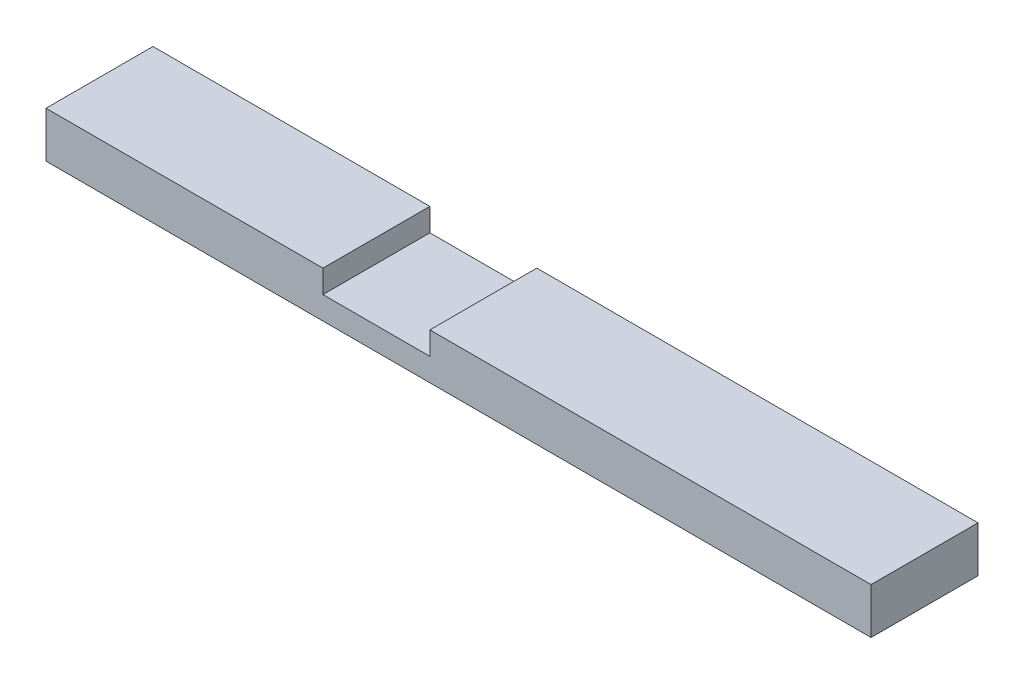
ISO-10303-21;
HEADER;
FILE_DESCRIPTION(('STEP AP214'),'2;1');
FILE_NAME('part.step','',(''),(''),'','','');
FILE_SCHEMA(('AUTOMOTIVE_DESIGN { 1 0 10303 214 1 1 1 1 }'));
ENDSEC;
DATA;
#1=APPLICATION_CONTEXT('core data for automotive mechanical design processes');
#2=APPLICATION_PROTOCOL_DEFINITION('international standard','automotive_design',2000,#1);
#3=PRODUCT_CONTEXT('',#1,'mechanical');
#4=PRODUCT('Part','Part','',(#3));
#5=PRODUCT_RELATED_PRODUCT_CATEGORY('part','',(#4));
#6=PRODUCT_DEFINITION_FORMATION('','',#4);
#7=PRODUCT_DEFINITION_CONTEXT('part definition',#1,'design');
#8=PRODUCT_DEFINITION('design','',#6,#7);
#9=PRODUCT_DEFINITION_SHAPE('','',#8);
#10=(LENGTH_UNIT() NAMED_UNIT(*) SI_UNIT(.MILLI.,.METRE.));
#11=(NAMED_UNIT(*) PLANE_ANGLE_UNIT() SI_UNIT($,.RADIAN.));
#12=(NAMED_UNIT(*) SI_UNIT($,.STERADIAN.) SOLID_ANGLE_UNIT());
#13=UNCERTAINTY_MEASURE_WITH_UNIT(LENGTH_MEASURE(1.E-05),#10,'distance_accuracy_value','');
#14=(GEOMETRIC_REPRESENTATION_CONTEXT(3) GLOBAL_UNCERTAINTY_ASSIGNED_CONTEXT((#13)) GLOBAL_UNIT_ASSIGNED_CONTEXT((#10,
#11,#12)) REPRESENTATION_CONTEXT('',''));
#15=CARTESIAN_POINT('',(0.,0.,0.));
#16=DIRECTION('',(0.,0.,1.));
#17=DIRECTION('',(1.,0.,0.));
#18=AXIS2_PLACEMENT_3D('',#15,#16,#17);
#19=CARTESIAN_POINT('',(0.,38.1,0.));
#20=DIRECTION('',(0.,-1.,0.));
#21=DIRECTION('',(0.,0.,-1.));
#22=AXIS2_PLACEMENT_3D('',#19,#20,#21);
#23=PLANE('',#22);
#24=DIRECTION('',(1.,0.,0.));
#25=VECTOR('',#24,1.);
#26=CARTESIAN_POINT('',(0.,38.1,0.));
#27=LINE('',#26,#25);
#28=CARTESIAN_POINT('',(0.,38.1,0.));
#29=VERTEX_POINT('',#28);
#30=CARTESIAN_POINT('',(230.1875,38.1,0.));
#31=VERTEX_POINT('',#30);
#32=EDGE_CURVE('E95',#29,#31,#27,.T.);
#33=ORIENTED_EDGE('',*,*,#32,.T.);
#34=DIRECTION('',(0.,0.,1.));
#35=VECTOR('',#34,1.);
#36=CARTESIAN_POINT('',(230.1875,38.1,-88.9));
#37=LINE('',#36,#35);
#38=CARTESIAN_POINT('',(230.1875,38.1,-88.9));
#39=VERTEX_POINT('',#38);
#40=EDGE_CURVE('E121',#39,#31,#37,.T.);
#41=ORIENTED_EDGE('',*,*,#40,.F.);
#42=DIRECTION('',(-1.,0.,0.));
#43=VECTOR('',#42,1.);
#44=CARTESIAN_POINT('',(0.,38.1,-88.9));
#45=LINE('',#44,#43);
#46=CARTESIAN_POINT('',(0.,38.1,-88.9));
#47=VERTEX_POINT('',#46);
#48=EDGE_CURVE('E66',#39,#47,#45,.T.);
#49=ORIENTED_EDGE('',*,*,#48,.T.);
#50=DIRECTION('',(0.,0.,1.));
#51=VECTOR('',#50,1.);
#52=CARTESIAN_POINT('',(0.,38.1,0.));
#53=LINE('',#52,#51);
#54=EDGE_CURVE('E161',#47,#29,#53,.T.);
#55=ORIENTED_EDGE('',*,*,#54,.T.);
#56=EDGE_LOOP('',(#33,#41,#49,#55));
#57=FACE_BOUND('',#56,.T.);
#58=ADVANCED_FACE('F41',(#57),#23,.F.);
#59=CARTESIAN_POINT('',(0.,38.1,0.));
#60=DIRECTION('',(1.,0.,0.));
#61=DIRECTION('',(0.,0.,-1.));
#62=AXIS2_PLACEMENT_3D('',#59,#60,#61);
#63=PLANE('',#62);
#64=DIRECTION('',(0.,0.,1.));
#65=VECTOR('',#64,1.);
#66=CARTESIAN_POINT('',(0.,0.,0.));
#67=LINE('',#66,#65);
#68=CARTESIAN_POINT('',(0.,0.,-88.9));
#69=VERTEX_POINT('',#68);
#70=CARTESIAN_POINT('',(0.,0.,0.));
#71=VERTEX_POINT('',#70);
#72=EDGE_CURVE('E154',#69,#71,#67,.T.);
#73=ORIENTED_EDGE('',*,*,#72,.T.);
#74=DIRECTION('',(0.,-1.,0.));
#75=VECTOR('',#74,1.);
#76=CARTESIAN_POINT('',(0.,38.1,0.));
#77=LINE('',#76,#75);
#78=EDGE_CURVE('E11',#29,#71,#77,.T.);
#79=ORIENTED_EDGE('',*,*,#78,.F.);
#80=ORIENTED_EDGE('',*,*,#54,.F.);
#81=DIRECTION('',(0.,-1.,0.));
#82=VECTOR('',#81,1.);
#83=CARTESIAN_POINT('',(0.,38.1,-88.9));
#84=LINE('',#83,#82);
#85=EDGE_CURVE('E174',#47,#69,#84,.T.);
#86=ORIENTED_EDGE('',*,*,#85,.T.);
#87=EDGE_LOOP('',(#73,#79,#80,#86));
#88=FACE_BOUND('',#87,.T.);
#89=ADVANCED_FACE('F43',(#88),#63,.F.);
#90=CARTESIAN_POINT('',(0.,38.1,0.));
#91=DIRECTION('',(0.,0.,-1.));
#92=DIRECTION('',(-1.,0.,0.));
#93=AXIS2_PLACEMENT_3D('',#90,#91,#92);
#94=PLANE('',#93);
#95=DIRECTION('',(1.,0.,0.));
#96=VECTOR('',#95,1.);
#97=CARTESIAN_POINT('',(230.1875,19.05,0.));
#98=LINE('',#97,#96);
#99=CARTESIAN_POINT('',(230.1875,19.05,0.));
#100=VERTEX_POINT('',#99);
#101=CARTESIAN_POINT('',(319.0875,19.05,0.));
#102=VERTEX_POINT('',#101);
#103=EDGE_CURVE('E130',#100,#102,#98,.T.);
#104=ORIENTED_EDGE('',*,*,#103,.F.);
#105=DIRECTION('',(0.,1.,0.));
#106=VECTOR('',#105,1.);
#107=CARTESIAN_POINT('',(230.1875,19.05,0.));
#108=LINE('',#107,#106);
#109=EDGE_CURVE('E116',#100,#31,#108,.T.);
#110=ORIENTED_EDGE('',*,*,#109,.T.);
#111=ORIENTED_EDGE('',*,*,#32,.F.);
#112=ORIENTED_EDGE('',*,*,#78,.T.);
#113=DIRECTION('',(1.,0.,0.));
#114=VECTOR('',#113,1.);
#115=CARTESIAN_POINT('',(0.,0.,0.));
#116=LINE('',#115,#114);
#117=CARTESIAN_POINT('',(685.8,0.,0.));
#118=VERTEX_POINT('',#117);
#119=EDGE_CURVE('E178',#71,#118,#116,.T.);
#120=ORIENTED_EDGE('',*,*,#119,.T.);
#121=DIRECTION('',(0.,-1.,0.));
#122=VECTOR('',#121,1.);
#123=CARTESIAN_POINT('',(685.8,38.1,0.));
#124=LINE('',#123,#122);
#125=CARTESIAN_POINT('',(685.8,38.1,0.));
#126=VERTEX_POINT('',#125);
#127=EDGE_CURVE('E50',#126,#118,#124,.T.);
#128=ORIENTED_EDGE('',*,*,#127,.F.);
#129=CARTESIAN_POINT('',(319.0875,38.1,0.));
#130=VERTEX_POINT('',#129);
#131=EDGE_CURVE('E164',#130,#126,#27,.T.);
#132=ORIENTED_EDGE('',*,*,#131,.F.);
#133=DIRECTION('',(0.,1.,0.));
#134=VECTOR('',#133,1.);
#135=CARTESIAN_POINT('',(319.0875,19.05,0.));
#136=LINE('',#135,#134);
#137=EDGE_CURVE('E57',#102,#130,#136,.T.);
#138=ORIENTED_EDGE('',*,*,#137,.F.);
#139=EDGE_LOOP('',(#104,#110,#111,#112,#120,#128,#132,#138));
#140=FACE_BOUND('',#139,.T.);
#141=ADVANCED_FACE('F136',(#140),#94,.F.);
#142=CARTESIAN_POINT('',(685.8,38.1,0.));
#143=DIRECTION('',(-1.,0.,0.));
#144=DIRECTION('',(0.,0.,1.));
#145=AXIS2_PLACEMENT_3D('',#142,#143,#144);
#146=PLANE('',#145);
#147=DIRECTION('',(0.,0.,-1.));
#148=VECTOR('',#147,1.);
#149=CARTESIAN_POINT('',(685.8,0.,0.));
#150=LINE('',#149,#148);
#151=CARTESIAN_POINT('',(685.8,0.,-88.9));
#152=VERTEX_POINT('',#151);
#153=EDGE_CURVE('E181',#118,#152,#150,.T.);
#154=ORIENTED_EDGE('',*,*,#153,.T.);
#155=DIRECTION('',(0.,-1.,0.));
#156=VECTOR('',#155,1.);
#157=CARTESIAN_POINT('',(685.8,38.1,-88.9));
#158=LINE('',#157,#156);
#159=CARTESIAN_POINT('',(685.8,38.1,-88.9));
#160=VERTEX_POINT('',#159);
#161=EDGE_CURVE('E188',#160,#152,#158,.T.);
#162=ORIENTED_EDGE('',*,*,#161,.F.);
#163=DIRECTION('',(0.,0.,-1.));
#164=VECTOR('',#163,1.);
#165=CARTESIAN_POINT('',(685.8,38.1,0.));
#166=LINE('',#165,#164);
#167=EDGE_CURVE('E167',#126,#160,#166,.T.);
#168=ORIENTED_EDGE('',*,*,#167,.F.);
#169=ORIENTED_EDGE('',*,*,#127,.T.);
#170=EDGE_LOOP('',(#154,#162,#168,#169));
#171=FACE_BOUND('',#170,.T.);
#172=ADVANCED_FACE('F197',(#171),#146,.F.);
#173=CARTESIAN_POINT('',(0.,38.1,-88.9));
#174=DIRECTION('',(0.,0.,1.));
#175=DIRECTION('',(1.,0.,0.));
#176=AXIS2_PLACEMENT_3D('',#173,#174,#175);
#177=PLANE('',#176);
#178=ORIENTED_EDGE('',*,*,#48,.F.);
#179=DIRECTION('',(0.,1.,0.));
#180=VECTOR('',#179,1.);
#181=CARTESIAN_POINT('',(230.1875,19.05,-88.9));
#182=LINE('',#181,#180);
#183=CARTESIAN_POINT('',(230.1875,19.05,-88.9));
#184=VERTEX_POINT('',#183);
#185=EDGE_CURVE('E151',#184,#39,#182,.T.);
#186=ORIENTED_EDGE('',*,*,#185,.F.);
#187=DIRECTION('',(-1.,0.,0.));
#188=VECTOR('',#187,1.);
#189=CARTESIAN_POINT('',(230.1875,19.05,-88.9));
#190=LINE('',#189,#188);
#191=CARTESIAN_POINT('',(319.0875,19.05,-88.9));
#192=VERTEX_POINT('',#191);
#193=EDGE_CURVE('E124',#192,#184,#190,.T.);
#194=ORIENTED_EDGE('',*,*,#193,.F.);
#195=DIRECTION('',(0.,1.,0.));
#196=VECTOR('',#195,1.);
#197=CARTESIAN_POINT('',(319.0875,19.05,-88.9));
#198=LINE('',#197,#196);
#199=CARTESIAN_POINT('',(319.0875,38.1,-88.9));
#200=VERTEX_POINT('',#199);
#201=EDGE_CURVE('E155',#192,#200,#198,.T.);
#202=ORIENTED_EDGE('',*,*,#201,.T.);
#203=EDGE_CURVE('E170',#160,#200,#45,.T.);
#204=ORIENTED_EDGE('',*,*,#203,.F.);
#205=ORIENTED_EDGE('',*,*,#161,.T.);
#206=DIRECTION('',(-1.,0.,0.));
#207=VECTOR('',#206,1.);
#208=CARTESIAN_POINT('',(0.,0.,-88.9));
#209=LINE('',#208,#207);
#210=EDGE_CURVE('E88',#152,#69,#209,.T.);
#211=ORIENTED_EDGE('',*,*,#210,.T.);
#212=ORIENTED_EDGE('',*,*,#85,.F.);
#213=EDGE_LOOP('',(#178,#186,#194,#202,#204,#205,#211,#212));
#214=FACE_BOUND('',#213,.T.);
#215=ADVANCED_FACE('F205',(#214),#177,.F.);
#216=ORIENTED_EDGE('',*,*,#203,.T.);
#217=DIRECTION('',(0.,0.,-1.));
#218=VECTOR('',#217,1.);
#219=CARTESIAN_POINT('',(319.0875,38.1,-88.9));
#220=LINE('',#219,#218);
#221=EDGE_CURVE('E134',#130,#200,#220,.T.);
#222=ORIENTED_EDGE('',*,*,#221,.F.);
#223=ORIENTED_EDGE('',*,*,#131,.T.);
#224=ORIENTED_EDGE('',*,*,#167,.T.);
#225=EDGE_LOOP('',(#216,#222,#223,#224));
#226=FACE_BOUND('',#225,.T.);
#227=ADVANCED_FACE('F225',(#226),#23,.F.);
#228=CARTESIAN_POINT('',(0.,0.,0.));
#229=DIRECTION('',(0.,-1.,0.));
#230=DIRECTION('',(0.,0.,-1.));
#231=AXIS2_PLACEMENT_3D('',#228,#229,#230);
#232=PLANE('',#231);
#233=ORIENTED_EDGE('',*,*,#72,.F.);
#234=ORIENTED_EDGE('',*,*,#210,.F.);
#235=ORIENTED_EDGE('',*,*,#153,.F.);
#236=ORIENTED_EDGE('',*,*,#119,.F.);
#237=EDGE_LOOP('',(#233,#234,#235,#236));
#238=FACE_BOUND('',#237,.T.);
#239=ADVANCED_FACE('F201',(#238),#232,.T.);
#240=CARTESIAN_POINT('',(230.1875,19.05,-88.9));
#241=DIRECTION('',(-1.,0.,0.));
#242=DIRECTION('',(0.,0.,1.));
#243=AXIS2_PLACEMENT_3D('',#240,#241,#242);
#244=PLANE('',#243);
#245=ORIENTED_EDGE('',*,*,#40,.T.);
#246=ORIENTED_EDGE('',*,*,#109,.F.);
#247=DIRECTION('',(0.,0.,1.));
#248=VECTOR('',#247,1.);
#249=CARTESIAN_POINT('',(230.1875,19.05,-88.9));
#250=LINE('',#249,#248);
#251=EDGE_CURVE('E119',#184,#100,#250,.T.);
#252=ORIENTED_EDGE('',*,*,#251,.F.);
#253=ORIENTED_EDGE('',*,*,#185,.T.);
#254=EDGE_LOOP('',(#245,#246,#252,#253));
#255=FACE_BOUND('',#254,.T.);
#256=ADVANCED_FACE('F118',(#255),#244,.F.);
#257=CARTESIAN_POINT('',(319.0875,19.05,-88.9));
#258=DIRECTION('',(1.,0.,0.));
#259=DIRECTION('',(0.,0.,-1.));
#260=AXIS2_PLACEMENT_3D('',#257,#258,#259);
#261=PLANE('',#260);
#262=ORIENTED_EDGE('',*,*,#221,.T.);
#263=ORIENTED_EDGE('',*,*,#201,.F.);
#264=DIRECTION('',(0.,0.,-1.));
#265=VECTOR('',#264,1.);
#266=CARTESIAN_POINT('',(319.0875,19.05,-88.9));
#267=LINE('',#266,#265);
#268=EDGE_CURVE('E139',#102,#192,#267,.T.);
#269=ORIENTED_EDGE('',*,*,#268,.F.);
#270=ORIENTED_EDGE('',*,*,#137,.T.);
#271=EDGE_LOOP('',(#262,#263,#269,#270));
#272=FACE_BOUND('',#271,.T.);
#273=ADVANCED_FACE('F227',(#272),#261,.F.);
#274=CARTESIAN_POINT('',(0.,19.05,0.));
#275=DIRECTION('',(0.,1.,0.));
#276=DIRECTION('',(0.,0.,1.));
#277=AXIS2_PLACEMENT_3D('',#274,#275,#276);
#278=PLANE('',#277);
#279=ORIENTED_EDGE('',*,*,#251,.T.);
#280=ORIENTED_EDGE('',*,*,#103,.T.);
#281=ORIENTED_EDGE('',*,*,#268,.T.);
#282=ORIENTED_EDGE('',*,*,#193,.T.);
#283=EDGE_LOOP('',(#279,#280,#281,#282));
#284=FACE_BOUND('',#283,.T.);
#285=ADVANCED_FACE('F128',(#284),#278,.T.);
#286=CLOSED_SHELL('',(#58,#89,#141,#172,#215,#227,#239,#256,#273,#285));
#287=MANIFOLD_SOLID_BREP('B2',#286);
#288=ADVANCED_BREP_SHAPE_REPRESENTATION('',(#18,#287),#14);
#289=SHAPE_DEFINITION_REPRESENTATION(#9,#288);
ENDSEC;
END-ISO-10303-21;
